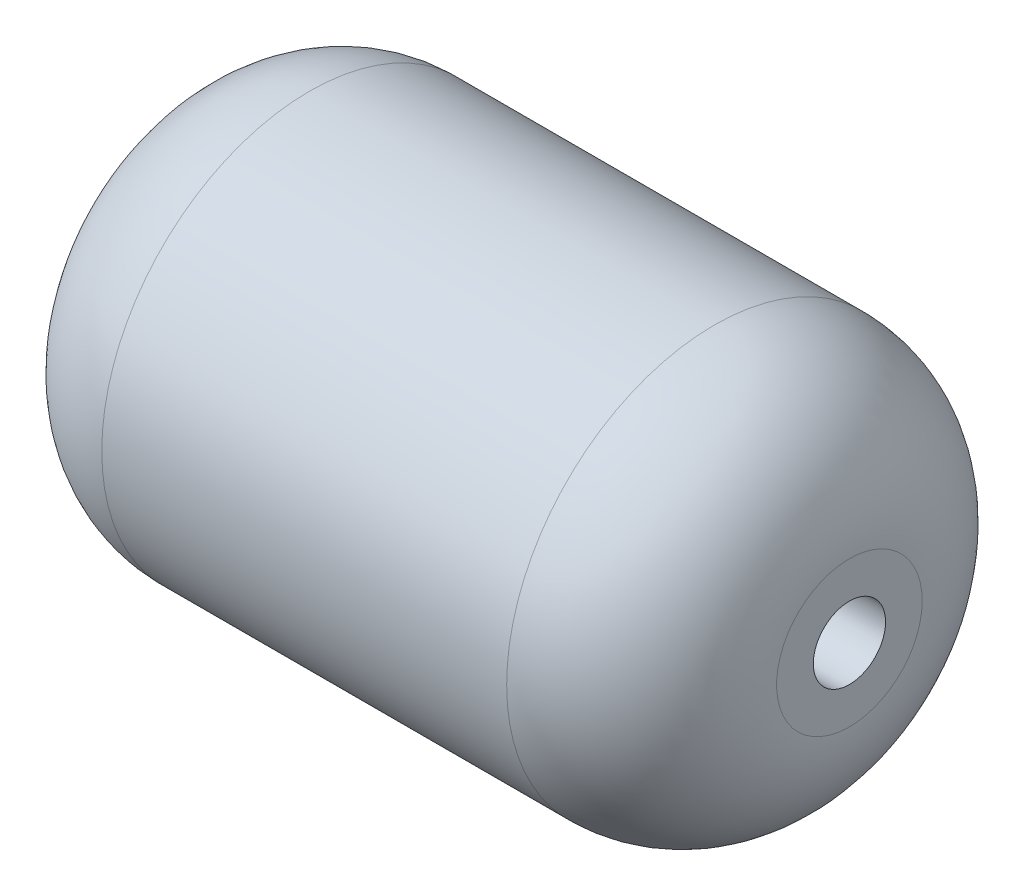
ISO-10303-21;
HEADER;
FILE_DESCRIPTION(('STEP AP214'),'2;1');
FILE_NAME('part.step','',(''),(''),'','','');
FILE_SCHEMA(('AUTOMOTIVE_DESIGN { 1 0 10303 214 1 1 1 1 }'));
ENDSEC;
DATA;
#1=APPLICATION_CONTEXT('core data for automotive mechanical design processes');
#2=APPLICATION_PROTOCOL_DEFINITION('international standard','automotive_design',2000,#1);
#3=PRODUCT_CONTEXT('',#1,'mechanical');
#4=PRODUCT('Part','Part','',(#3));
#5=PRODUCT_RELATED_PRODUCT_CATEGORY('part','',(#4));
#6=PRODUCT_DEFINITION_FORMATION('','',#4);
#7=PRODUCT_DEFINITION_CONTEXT('part definition',#1,'design');
#8=PRODUCT_DEFINITION('design','',#6,#7);
#9=PRODUCT_DEFINITION_SHAPE('','',#8);
#10=(LENGTH_UNIT() NAMED_UNIT(*) SI_UNIT(.MILLI.,.METRE.));
#11=(NAMED_UNIT(*) PLANE_ANGLE_UNIT() SI_UNIT($,.RADIAN.));
#12=(NAMED_UNIT(*) SI_UNIT($,.STERADIAN.) SOLID_ANGLE_UNIT());
#13=UNCERTAINTY_MEASURE_WITH_UNIT(LENGTH_MEASURE(1.E-05),#10,'distance_accuracy_value','');
#14=(GEOMETRIC_REPRESENTATION_CONTEXT(3) GLOBAL_UNCERTAINTY_ASSIGNED_CONTEXT((#13)) GLOBAL_UNIT_ASSIGNED_CONTEXT((#10,
#11,#12)) REPRESENTATION_CONTEXT('',''));
#15=CARTESIAN_POINT('',(0.,0.,0.));
#16=DIRECTION('',(0.,0.,1.));
#17=DIRECTION('',(1.,0.,0.));
#18=AXIS2_PLACEMENT_3D('',#15,#16,#17);
#19=CARTESIAN_POINT('',(-60.,0.,0.));
#20=DIRECTION('',(1.,0.,0.));
#21=DIRECTION('',(0.,0.,-1.));
#22=AXIS2_PLACEMENT_3D('',#19,#20,#21);
#23=DEGENERATE_TOROIDAL_SURFACE('',#22,21.5791002035531,40.,.T.);
#24=CARTESIAN_POINT('',(-100.,0.,0.));
#25=DIRECTION('',(1.,0.,0.));
#26=DIRECTION('',(0.,0.,-1.));
#27=AXIS2_PLACEMENT_3D('',#24,#25,#26);
#28=CIRCLE('',#27,21.579100203553);
#29=CARTESIAN_POINT('',(-100.,0.,-21.579100203553));
#30=VERTEX_POINT('',#29);
#31=EDGE_CURVE('E10',#30,#30,#28,.T.);
#32=ORIENTED_EDGE('',*,*,#31,.T.);
#33=EDGE_LOOP('',(#32));
#34=FACE_BOUND('',#33,.T.);
#35=CARTESIAN_POINT('',(-60.0000000000001,0.,0.));
#36=DIRECTION('',(1.,0.,0.));
#37=DIRECTION('',(0.,0.,-1.));
#38=AXIS2_PLACEMENT_3D('',#35,#36,#37);
#39=CIRCLE('',#38,61.5791002035531);
#40=CARTESIAN_POINT('',(-60.0000000000001,0.,-61.5791002035531));
#41=VERTEX_POINT('',#40);
#42=EDGE_CURVE('E58',#41,#41,#39,.T.);
#43=ORIENTED_EDGE('',*,*,#42,.F.);
#44=EDGE_LOOP('',(#43));
#45=FACE_BOUND('',#44,.T.);
#46=ADVANCED_FACE('F35',(#34,#45),#23,.T.);
#47=CARTESIAN_POINT('',(-100.,21.579100203553,0.));
#48=DIRECTION('',(-1.,0.,0.));
#49=DIRECTION('',(0.,0.,1.));
#50=AXIS2_PLACEMENT_3D('',#47,#48,#49);
#51=PLANE('',#50);
#52=CARTESIAN_POINT('',(-100.,0.,0.));
#53=DIRECTION('',(1.,0.,0.));
#54=DIRECTION('',(0.,0.,-1.));
#55=AXIS2_PLACEMENT_3D('',#52,#53,#54);
#56=CIRCLE('',#55,10.707094488578);
#57=CARTESIAN_POINT('',(-100.,0.,-10.707094488578));
#58=VERTEX_POINT('',#57);
#59=EDGE_CURVE('E42',#58,#58,#56,.T.);
#60=ORIENTED_EDGE('',*,*,#59,.T.);
#61=EDGE_LOOP('',(#60));
#62=FACE_BOUND('',#61,.T.);
#63=ORIENTED_EDGE('',*,*,#31,.F.);
#64=EDGE_LOOP('',(#63));
#65=FACE_BOUND('',#64,.T.);
#66=ADVANCED_FACE('F132',(#62,#65),#51,.T.);
#67=CARTESIAN_POINT('',(0.,0.,0.));
#68=DIRECTION('',(1.,0.,0.));
#69=DIRECTION('',(0.,0.,-1.));
#70=AXIS2_PLACEMENT_3D('',#67,#68,#69);
#71=CYLINDRICAL_SURFACE('',#70,10.707094488578);
#72=CARTESIAN_POINT('',(100.,0.,0.));
#73=DIRECTION('',(1.,0.,0.));
#74=DIRECTION('',(0.,0.,-1.));
#75=AXIS2_PLACEMENT_3D('',#72,#73,#74);
#76=CIRCLE('',#75,10.707094488578);
#77=CARTESIAN_POINT('',(100.,0.,-10.707094488578));
#78=VERTEX_POINT('',#77);
#79=EDGE_CURVE('E46',#78,#78,#76,.T.);
#80=ORIENTED_EDGE('',*,*,#79,.T.);
#81=EDGE_LOOP('',(#80));
#82=FACE_BOUND('',#81,.T.);
#83=ORIENTED_EDGE('',*,*,#59,.F.);
#84=EDGE_LOOP('',(#83));
#85=FACE_BOUND('',#84,.T.);
#86=ADVANCED_FACE('F129',(#82,#85),#71,.F.);
#87=CARTESIAN_POINT('',(100.,21.579100203553,0.));
#88=DIRECTION('',(1.,0.,0.));
#89=DIRECTION('',(0.,0.,-1.));
#90=AXIS2_PLACEMENT_3D('',#87,#88,#89);
#91=PLANE('',#90);
#92=CARTESIAN_POINT('',(100.,0.,0.));
#93=DIRECTION('',(1.,0.,0.));
#94=DIRECTION('',(0.,0.,-1.));
#95=AXIS2_PLACEMENT_3D('',#92,#93,#94);
#96=CIRCLE('',#95,21.579100203553);
#97=CARTESIAN_POINT('',(100.,0.,-21.579100203553));
#98=VERTEX_POINT('',#97);
#99=EDGE_CURVE('E50',#98,#98,#96,.T.);
#100=ORIENTED_EDGE('',*,*,#99,.T.);
#101=EDGE_LOOP('',(#100));
#102=FACE_BOUND('',#101,.T.);
#103=ORIENTED_EDGE('',*,*,#79,.F.);
#104=EDGE_LOOP('',(#103));
#105=FACE_BOUND('',#104,.T.);
#106=ADVANCED_FACE('F125',(#102,#105),#91,.T.);
#107=CARTESIAN_POINT('',(60.,0.,0.));
#108=DIRECTION('',(1.,0.,0.));
#109=DIRECTION('',(0.,0.,-1.));
#110=AXIS2_PLACEMENT_3D('',#107,#108,#109);
#111=DEGENERATE_TOROIDAL_SURFACE('',#110,21.5791002035531,40.,.T.);
#112=CARTESIAN_POINT('',(60.0000000000001,0.,0.));
#113=DIRECTION('',(1.,0.,0.));
#114=DIRECTION('',(0.,0.,-1.));
#115=AXIS2_PLACEMENT_3D('',#112,#113,#114);
#116=CIRCLE('',#115,61.5791002035531);
#117=CARTESIAN_POINT('',(60.0000000000001,0.,-61.5791002035531));
#118=VERTEX_POINT('',#117);
#119=EDGE_CURVE('E55',#118,#118,#116,.T.);
#120=ORIENTED_EDGE('',*,*,#119,.T.);
#121=EDGE_LOOP('',(#120));
#122=FACE_BOUND('',#121,.T.);
#123=ORIENTED_EDGE('',*,*,#99,.F.);
#124=EDGE_LOOP('',(#123));
#125=FACE_BOUND('',#124,.T.);
#126=ADVANCED_FACE('F121',(#122,#125),#111,.T.);
#127=CARTESIAN_POINT('',(0.,0.,0.));
#128=DIRECTION('',(1.,0.,0.));
#129=DIRECTION('',(0.,0.,-1.));
#130=AXIS2_PLACEMENT_3D('',#127,#128,#129);
#131=CYLINDRICAL_SURFACE('',#130,61.5791002035531);
#132=ORIENTED_EDGE('',*,*,#42,.T.);
#133=EDGE_LOOP('',(#132));
#134=FACE_BOUND('',#133,.T.);
#135=ORIENTED_EDGE('',*,*,#119,.F.);
#136=EDGE_LOOP('',(#135));
#137=FACE_BOUND('',#136,.T.);
#138=ADVANCED_FACE('F118',(#134,#137),#131,.T.);
#139=CLOSED_SHELL('',(#46,#66,#86,#106,#126,#138));
#140=CARTESIAN_POINT('',(-60.,0.,0.));
#141=DIRECTION('',(1.,0.,0.));
#142=DIRECTION('',(0.,0.,-1.));
#143=AXIS2_PLACEMENT_3D('',#140,#141,#142);
#144=DEGENERATE_TOROIDAL_SURFACE('',#143,21.5791002035531,37.46,.T.);
#145=CARTESIAN_POINT('',(-97.46,0.,0.));
#146=DIRECTION('',(1.,0.,0.));
#147=DIRECTION('',(0.,0.,-1.));
#148=AXIS2_PLACEMENT_3D('',#145,#146,#147);
#149=CIRCLE('',#148,21.579100203553);
#150=CARTESIAN_POINT('',(-97.46,0.,-21.579100203553));
#151=VERTEX_POINT('',#150);
#152=EDGE_CURVE('E76',#151,#151,#149,.T.);
#153=ORIENTED_EDGE('',*,*,#152,.F.);
#154=EDGE_LOOP('',(#153));
#155=FACE_BOUND('',#154,.T.);
#156=CARTESIAN_POINT('',(-60.,0.,0.));
#157=DIRECTION('',(1.,0.,0.));
#158=DIRECTION('',(0.,0.,-1.));
#159=AXIS2_PLACEMENT_3D('',#156,#157,#158);
#160=CIRCLE('',#159,59.0391002035531);
#161=CARTESIAN_POINT('',(-60.,0.,-59.0391002035531));
#162=VERTEX_POINT('',#161);
#163=EDGE_CURVE('E61',#162,#162,#160,.T.);
#164=ORIENTED_EDGE('',*,*,#163,.T.);
#165=EDGE_LOOP('',(#164));
#166=FACE_BOUND('',#165,.T.);
#167=ADVANCED_FACE('F82',(#155,#166),#144,.F.);
#168=CARTESIAN_POINT('',(0.,0.,0.));
#169=DIRECTION('',(1.,0.,0.));
#170=DIRECTION('',(0.,0.,-1.));
#171=AXIS2_PLACEMENT_3D('',#168,#169,#170);
#172=CYLINDRICAL_SURFACE('',#171,59.0391002035531);
#173=ORIENTED_EDGE('',*,*,#163,.F.);
#174=EDGE_LOOP('',(#173));
#175=FACE_BOUND('',#174,.T.);
#176=CARTESIAN_POINT('',(60.0000000000001,0.,0.));
#177=DIRECTION('',(1.,0.,0.));
#178=DIRECTION('',(0.,0.,-1.));
#179=AXIS2_PLACEMENT_3D('',#176,#177,#178);
#180=CIRCLE('',#179,59.0391002035531);
#181=CARTESIAN_POINT('',(60.0000000000001,0.,-59.0391002035531));
#182=VERTEX_POINT('',#181);
#183=EDGE_CURVE('E64',#182,#182,#180,.T.);
#184=ORIENTED_EDGE('',*,*,#183,.T.);
#185=EDGE_LOOP('',(#184));
#186=FACE_BOUND('',#185,.T.);
#187=ADVANCED_FACE('F85',(#175,#186),#172,.F.);
#188=CARTESIAN_POINT('',(60.,0.,0.));
#189=DIRECTION('',(1.,0.,0.));
#190=DIRECTION('',(0.,0.,-1.));
#191=AXIS2_PLACEMENT_3D('',#188,#189,#190);
#192=DEGENERATE_TOROIDAL_SURFACE('',#191,21.5791002035531,37.46,.T.);
#193=ORIENTED_EDGE('',*,*,#183,.F.);
#194=EDGE_LOOP('',(#193));
#195=FACE_BOUND('',#194,.T.);
#196=CARTESIAN_POINT('',(97.46,0.,0.));
#197=DIRECTION('',(1.,0.,0.));
#198=DIRECTION('',(0.,0.,-1.));
#199=AXIS2_PLACEMENT_3D('',#196,#197,#198);
#200=CIRCLE('',#199,21.579100203553);
#201=CARTESIAN_POINT('',(97.46,0.,-21.579100203553));
#202=VERTEX_POINT('',#201);
#203=EDGE_CURVE('E67',#202,#202,#200,.T.);
#204=ORIENTED_EDGE('',*,*,#203,.T.);
#205=EDGE_LOOP('',(#204));
#206=FACE_BOUND('',#205,.T.);
#207=ADVANCED_FACE('F92',(#195,#206),#192,.F.);
#208=CARTESIAN_POINT('',(97.46,21.579100203553,0.));
#209=DIRECTION('',(1.,0.,0.));
#210=DIRECTION('',(0.,0.,-1.));
#211=AXIS2_PLACEMENT_3D('',#208,#209,#210);
#212=PLANE('',#211);
#213=ORIENTED_EDGE('',*,*,#203,.F.);
#214=EDGE_LOOP('',(#213));
#215=FACE_BOUND('',#214,.T.);
#216=CARTESIAN_POINT('',(97.46,0.,0.));
#217=DIRECTION('',(1.,0.,0.));
#218=DIRECTION('',(0.,0.,-1.));
#219=AXIS2_PLACEMENT_3D('',#216,#217,#218);
#220=CIRCLE('',#219,13.247094488578);
#221=CARTESIAN_POINT('',(97.46,0.,-13.247094488578));
#222=VERTEX_POINT('',#221);
#223=EDGE_CURVE('E70',#222,#222,#220,.T.);
#224=ORIENTED_EDGE('',*,*,#223,.T.);
#225=EDGE_LOOP('',(#224));
#226=FACE_BOUND('',#225,.T.);
#227=ADVANCED_FACE('F98',(#215,#226),#212,.F.);
#228=CARTESIAN_POINT('',(0.,0.,0.));
#229=DIRECTION('',(1.,0.,0.));
#230=DIRECTION('',(0.,0.,-1.));
#231=AXIS2_PLACEMENT_3D('',#228,#229,#230);
#232=CYLINDRICAL_SURFACE('',#231,13.247094488578);
#233=ORIENTED_EDGE('',*,*,#223,.F.);
#234=EDGE_LOOP('',(#233));
#235=FACE_BOUND('',#234,.T.);
#236=CARTESIAN_POINT('',(-97.46,0.,0.));
#237=DIRECTION('',(1.,0.,0.));
#238=DIRECTION('',(0.,0.,-1.));
#239=AXIS2_PLACEMENT_3D('',#236,#237,#238);
#240=CIRCLE('',#239,13.247094488578);
#241=CARTESIAN_POINT('',(-97.46,0.,-13.247094488578));
#242=VERTEX_POINT('',#241);
#243=EDGE_CURVE('E73',#242,#242,#240,.T.);
#244=ORIENTED_EDGE('',*,*,#243,.T.);
#245=EDGE_LOOP('',(#244));
#246=FACE_BOUND('',#245,.T.);
#247=ADVANCED_FACE('F104',(#235,#246),#232,.T.);
#248=CARTESIAN_POINT('',(-97.46,21.579100203553,0.));
#249=DIRECTION('',(-1.,0.,0.));
#250=DIRECTION('',(0.,0.,1.));
#251=AXIS2_PLACEMENT_3D('',#248,#249,#250);
#252=PLANE('',#251);
#253=ORIENTED_EDGE('',*,*,#243,.F.);
#254=EDGE_LOOP('',(#253));
#255=FACE_BOUND('',#254,.T.);
#256=ORIENTED_EDGE('',*,*,#152,.T.);
#257=EDGE_LOOP('',(#256));
#258=FACE_BOUND('',#257,.T.);
#259=ADVANCED_FACE('F80',(#255,#258),#252,.F.);
#260=CLOSED_SHELL('',(#167,#187,#207,#227,#247,#259));
#261=ORIENTED_CLOSED_SHELL('',*,#260,.T.);
#262=BREP_WITH_VOIDS('B2',#139,(#261));
#263=ADVANCED_BREP_SHAPE_REPRESENTATION('',(#18,#262),#14);
#264=SHAPE_DEFINITION_REPRESENTATION(#9,#263);
ENDSEC;
END-ISO-10303-21;
